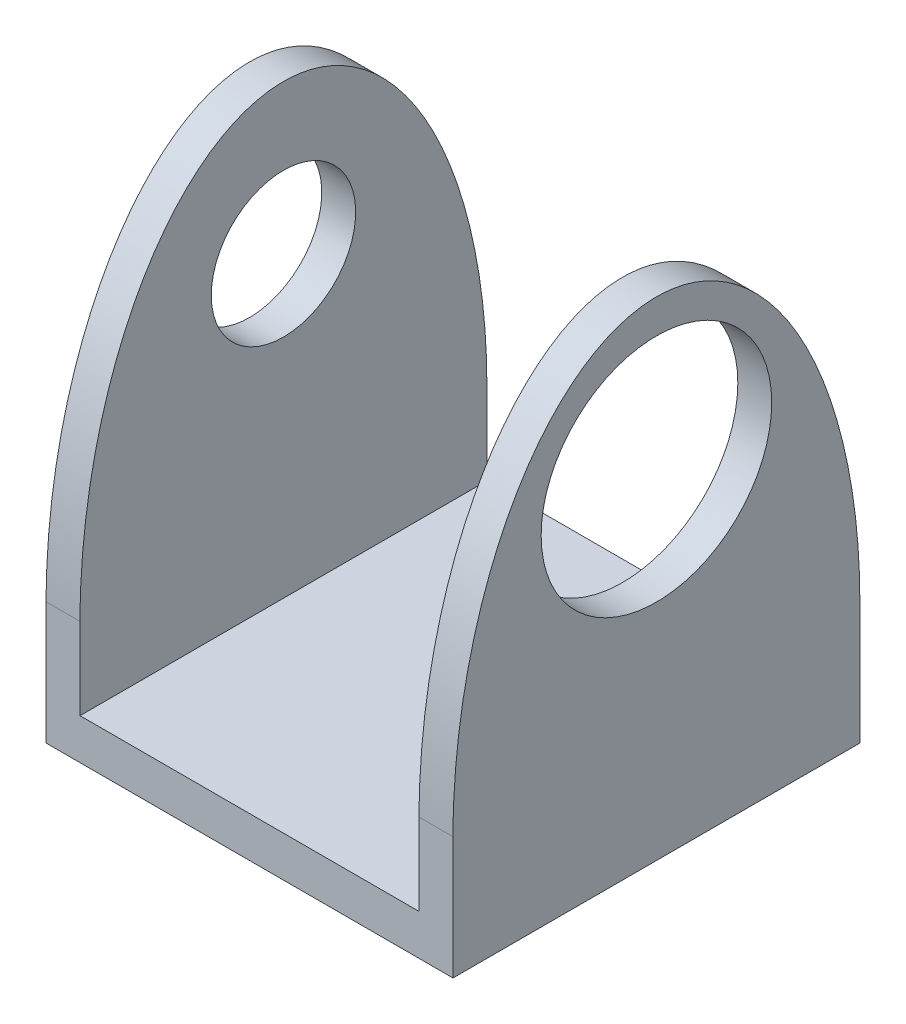
ISO-10303-21;
HEADER;
FILE_DESCRIPTION(('STEP AP214'),'2;1');
FILE_NAME('part.step','',(''),(''),'','','');
FILE_SCHEMA(('AUTOMOTIVE_DESIGN { 1 0 10303 214 1 1 1 1 }'));
ENDSEC;
DATA;
#1=APPLICATION_CONTEXT('core data for automotive mechanical design processes');
#2=APPLICATION_PROTOCOL_DEFINITION('international standard','automotive_design',2000,#1);
#3=PRODUCT_CONTEXT('',#1,'mechanical');
#4=PRODUCT('Part','Part','',(#3));
#5=PRODUCT_RELATED_PRODUCT_CATEGORY('part','',(#4));
#6=PRODUCT_DEFINITION_FORMATION('','',#4);
#7=PRODUCT_DEFINITION_CONTEXT('part definition',#1,'design');
#8=PRODUCT_DEFINITION('design','',#6,#7);
#9=PRODUCT_DEFINITION_SHAPE('','',#8);
#10=(LENGTH_UNIT() NAMED_UNIT(*) SI_UNIT(.MILLI.,.METRE.));
#11=(NAMED_UNIT(*) PLANE_ANGLE_UNIT() SI_UNIT($,.RADIAN.));
#12=(NAMED_UNIT(*) SI_UNIT($,.STERADIAN.) SOLID_ANGLE_UNIT());
#13=UNCERTAINTY_MEASURE_WITH_UNIT(LENGTH_MEASURE(1.E-05),#10,'distance_accuracy_value','');
#14=(GEOMETRIC_REPRESENTATION_CONTEXT(3) GLOBAL_UNCERTAINTY_ASSIGNED_CONTEXT((#13)) GLOBAL_UNIT_ASSIGNED_CONTEXT((#10,
#11,#12)) REPRESENTATION_CONTEXT('',''));
#15=CARTESIAN_POINT('',(0.,0.,0.));
#16=DIRECTION('',(0.,0.,1.));
#17=DIRECTION('',(1.,0.,0.));
#18=AXIS2_PLACEMENT_3D('',#15,#16,#17);
#19=CARTESIAN_POINT('',(-3.35387323943662,-2.29181338028169,7.62));
#20=DIRECTION('',(0.,1.,0.));
#21=DIRECTION('',(0.,0.,1.));
#22=AXIS2_PLACEMENT_3D('',#19,#20,#21);
#23=PLANE('',#22);
#24=DIRECTION('',(1.,0.,0.));
#25=VECTOR('',#24,1.);
#26=CARTESIAN_POINT('',(-3.35387323943662,-2.29181338028169,0.));
#27=LINE('',#26,#25);
#28=CARTESIAN_POINT('',(-3.35387323943662,-2.29181338028169,0.));
#29=VERTEX_POINT('',#28);
#30=CARTESIAN_POINT('',(4.26612676056338,-2.29181338028169,0.));
#31=VERTEX_POINT('',#30);
#32=EDGE_CURVE('E221',#29,#31,#27,.T.);
#33=ORIENTED_EDGE('',*,*,#32,.T.);
#34=DIRECTION('',(0.,0.,-1.));
#35=VECTOR('',#34,1.);
#36=CARTESIAN_POINT('',(4.26612676056338,-2.29181338028169,7.62));
#37=LINE('',#36,#35);
#38=CARTESIAN_POINT('',(4.26612676056338,-2.29181338028169,7.62));
#39=VERTEX_POINT('',#38);
#40=EDGE_CURVE('E224',#39,#31,#37,.T.);
#41=ORIENTED_EDGE('',*,*,#40,.F.);
#42=DIRECTION('',(1.,0.,0.));
#43=VECTOR('',#42,1.);
#44=CARTESIAN_POINT('',(-3.35387323943662,-2.29181338028169,7.62));
#45=LINE('',#44,#43);
#46=CARTESIAN_POINT('',(-3.35387323943662,-2.29181338028169,7.62));
#47=VERTEX_POINT('',#46);
#48=EDGE_CURVE('E279',#47,#39,#45,.T.);
#49=ORIENTED_EDGE('',*,*,#48,.F.);
#50=DIRECTION('',(0.,0.,-1.));
#51=VECTOR('',#50,1.);
#52=CARTESIAN_POINT('',(-3.35387323943662,-2.29181338028169,7.62));
#53=LINE('',#52,#51);
#54=EDGE_CURVE('E227',#47,#29,#53,.T.);
#55=ORIENTED_EDGE('',*,*,#54,.T.);
#56=EDGE_LOOP('',(#33,#41,#49,#55));
#57=FACE_BOUND('',#56,.T.);
#58=DIRECTION('',(0.,0.,1.));
#59=VECTOR('',#58,1.);
#60=CARTESIAN_POINT('',(3.25908068825592,-2.29181338028169,1.44789902015817));
#61=LINE('',#60,#59);
#62=CARTESIAN_POINT('',(3.25908068825592,-2.29181338028169,1.44789902015817));
#63=VERTEX_POINT('',#62);
#64=CARTESIAN_POINT('',(3.25908068825592,-2.29181338028169,6.23741252767155));
#65=VERTEX_POINT('',#64);
#66=EDGE_CURVE('E57',#63,#65,#61,.T.);
#67=ORIENTED_EDGE('',*,*,#66,.F.);
#68=DIRECTION('',(1.,0.,0.));
#69=VECTOR('',#68,1.);
#70=CARTESIAN_POINT('',(-2.08558097581017,-2.29181338028169,1.44789902015817));
#71=LINE('',#70,#69);
#72=CARTESIAN_POINT('',(-2.08558097581017,-2.29181338028169,1.44789902015817));
#73=VERTEX_POINT('',#72);
#74=EDGE_CURVE('E61',#73,#63,#71,.T.);
#75=ORIENTED_EDGE('',*,*,#74,.F.);
#76=DIRECTION('',(0.,0.,-1.));
#77=VECTOR('',#76,1.);
#78=CARTESIAN_POINT('',(-2.08558097581017,-2.29181338028169,6.23741252767155));
#79=LINE('',#78,#77);
#80=CARTESIAN_POINT('',(-2.08558097581017,-2.29181338028169,6.23741252767155));
#81=VERTEX_POINT('',#80);
#82=EDGE_CURVE('E449',#81,#73,#79,.T.);
#83=ORIENTED_EDGE('',*,*,#82,.F.);
#84=DIRECTION('',(-1.,0.,0.));
#85=VECTOR('',#84,1.);
#86=CARTESIAN_POINT('',(3.25908068825592,-2.29181338028169,6.23741252767155));
#87=LINE('',#86,#85);
#88=EDGE_CURVE('E459',#65,#81,#87,.T.);
#89=ORIENTED_EDGE('',*,*,#88,.F.);
#90=EDGE_LOOP('',(#67,#75,#83,#89));
#91=FACE_BOUND('',#90,.T.);
#92=ADVANCED_FACE('F41',(#57,#91),#23,.F.);
#93=CARTESIAN_POINT('',(-3.35387323943662,6.85218661971831,7.62));
#94=DIRECTION('',(1.,0.,0.));
#95=DIRECTION('',(0.,1.,0.));
#96=AXIS2_PLACEMENT_3D('',#93,#94,#95);
#97=PLANE('',#96);
#98=CARTESIAN_POINT('',(-3.35387323943662,4.05818661971831,3.81));
#99=DIRECTION('',(-1.,0.,0.));
#100=DIRECTION('',(0.,0.,1.));
#101=AXIS2_PLACEMENT_3D('',#98,#99,#100);
#102=CIRCLE('',#101,1.35254999999999);
#103=CARTESIAN_POINT('',(-3.35387323943662,4.05818661971831,5.16254999999999));
#104=VERTEX_POINT('',#103);
#105=EDGE_CURVE('E294',#104,#104,#102,.T.);
#106=ORIENTED_EDGE('',*,*,#105,.F.);
#107=EDGE_LOOP('',(#106));
#108=FACE_BOUND('',#107,.T.);
#109=DIRECTION('',(0.,-1.,0.));
#110=VECTOR('',#109,1.);
#111=CARTESIAN_POINT('',(-3.35387323943662,6.85218661971831,7.62));
#112=LINE('',#111,#110);
#113=CARTESIAN_POINT('',(-3.35387323943662,0.,7.62));
#114=VERTEX_POINT('',#113);
#115=EDGE_CURVE('E257',#114,#47,#112,.T.);
#116=ORIENTED_EDGE('',*,*,#115,.F.);
#117=CARTESIAN_POINT('',(-3.35387323943662,0.,3.81));
#118=DIRECTION('',(1.,0.,0.));
#119=DIRECTION('',(0.,1.,0.));
#120=AXIS2_PLACEMENT_3D('',#117,#118,#119);
#121=ELLIPSE('',#120,6.85218661971831,3.81);
#122=CARTESIAN_POINT('',(-3.35387323943662,0.,0.));
#123=VERTEX_POINT('',#122);
#124=EDGE_CURVE('E165',#123,#114,#121,.T.);
#125=ORIENTED_EDGE('',*,*,#124,.F.);
#126=DIRECTION('',(0.,-1.,0.));
#127=VECTOR('',#126,1.);
#128=CARTESIAN_POINT('',(-3.35387323943662,6.85218661971831,0.));
#129=LINE('',#128,#127);
#130=EDGE_CURVE('E232',#123,#29,#129,.T.);
#131=ORIENTED_EDGE('',*,*,#130,.T.);
#132=ORIENTED_EDGE('',*,*,#54,.F.);
#133=EDGE_LOOP('',(#116,#125,#131,#132));
#134=FACE_BOUND('',#133,.T.);
#135=ADVANCED_FACE('F43',(#108,#134),#97,.F.);
#136=CARTESIAN_POINT('',(4.26612676056338,-2.29181338028169,7.62));
#137=DIRECTION('',(-1.,0.,0.));
#138=DIRECTION('',(0.,-1.,0.));
#139=AXIS2_PLACEMENT_3D('',#136,#137,#138);
#140=PLANE('',#139);
#141=CARTESIAN_POINT('',(4.26612676056338,4.05818661971831,3.81));
#142=DIRECTION('',(1.,0.,0.));
#143=DIRECTION('',(0.,0.,-1.));
#144=AXIS2_PLACEMENT_3D('',#141,#142,#143);
#145=CIRCLE('',#144,2.159);
#146=CARTESIAN_POINT('',(4.26612676056338,4.05818661971831,1.651));
#147=VERTEX_POINT('',#146);
#148=EDGE_CURVE('E298',#147,#147,#145,.T.);
#149=ORIENTED_EDGE('',*,*,#148,.F.);
#150=EDGE_LOOP('',(#149));
#151=FACE_BOUND('',#150,.T.);
#152=CARTESIAN_POINT('',(4.26612676056338,0.,3.81));
#153=DIRECTION('',(1.,0.,0.));
#154=DIRECTION('',(0.,1.,0.));
#155=AXIS2_PLACEMENT_3D('',#152,#153,#154);
#156=ELLIPSE('',#155,6.85218661971831,3.81);
#157=CARTESIAN_POINT('',(4.26612676056338,0.,0.));
#158=VERTEX_POINT('',#157);
#159=CARTESIAN_POINT('',(4.26612676056338,0.,7.62));
#160=VERTEX_POINT('',#159);
#161=EDGE_CURVE('E159',#158,#160,#156,.T.);
#162=ORIENTED_EDGE('',*,*,#161,.T.);
#163=DIRECTION('',(0.,1.,0.));
#164=VECTOR('',#163,1.);
#165=CARTESIAN_POINT('',(4.26612676056338,-2.29181338028169,7.62));
#166=LINE('',#165,#164);
#167=EDGE_CURVE('E237',#39,#160,#166,.T.);
#168=ORIENTED_EDGE('',*,*,#167,.F.);
#169=ORIENTED_EDGE('',*,*,#40,.T.);
#170=DIRECTION('',(0.,1.,0.));
#171=VECTOR('',#170,1.);
#172=CARTESIAN_POINT('',(4.26612676056338,-2.29181338028169,0.));
#173=LINE('',#172,#171);
#174=EDGE_CURVE('E231',#31,#158,#173,.T.);
#175=ORIENTED_EDGE('',*,*,#174,.T.);
#176=EDGE_LOOP('',(#162,#168,#169,#175));
#177=FACE_BOUND('',#176,.T.);
#178=ADVANCED_FACE('F206',(#151,#177),#140,.F.);
#179=CARTESIAN_POINT('',(3.63112676056338,6.85218661971831,7.62));
#180=DIRECTION('',(1.,0.,0.));
#181=DIRECTION('',(0.,1.,0.));
#182=AXIS2_PLACEMENT_3D('',#179,#180,#181);
#183=PLANE('',#182);
#184=CARTESIAN_POINT('',(3.63112676056338,4.05818661971831,3.81));
#185=DIRECTION('',(1.,0.,0.));
#186=DIRECTION('',(0.,1.,0.));
#187=AXIS2_PLACEMENT_3D('',#184,#185,#186);
#188=CIRCLE('',#187,2.159);
#189=CARTESIAN_POINT('',(3.63112676056338,6.21718661971831,3.81));
#190=VERTEX_POINT('',#189);
#191=EDGE_CURVE('E303',#190,#190,#188,.F.);
#192=ORIENTED_EDGE('',*,*,#191,.F.);
#193=EDGE_LOOP('',(#192));
#194=FACE_BOUND('',#193,.T.);
#195=DIRECTION('',(0.,-1.,0.));
#196=VECTOR('',#195,1.);
#197=CARTESIAN_POINT('',(3.63112676056338,6.85218661971831,7.62));
#198=LINE('',#197,#196);
#199=CARTESIAN_POINT('',(3.63112676056338,0.,7.62));
#200=VERTEX_POINT('',#199);
#201=CARTESIAN_POINT('',(3.63112676056338,-1.52981338028169,7.62));
#202=VERTEX_POINT('',#201);
#203=EDGE_CURVE('E274',#200,#202,#198,.T.);
#204=ORIENTED_EDGE('',*,*,#203,.F.);
#205=CARTESIAN_POINT('',(3.63112676056338,0.,3.81));
#206=DIRECTION('',(1.,0.,0.));
#207=DIRECTION('',(0.,1.,0.));
#208=AXIS2_PLACEMENT_3D('',#205,#206,#207);
#209=ELLIPSE('',#208,6.85218661971831,3.81);
#210=CARTESIAN_POINT('',(3.63112676056338,0.,0.));
#211=VERTEX_POINT('',#210);
#212=EDGE_CURVE('E309',#211,#200,#209,.T.);
#213=ORIENTED_EDGE('',*,*,#212,.F.);
#214=DIRECTION('',(0.,-1.,0.));
#215=VECTOR('',#214,1.);
#216=CARTESIAN_POINT('',(3.63112676056338,6.85218661971831,0.));
#217=LINE('',#216,#215);
#218=CARTESIAN_POINT('',(3.63112676056338,-1.52981338028169,0.));
#219=VERTEX_POINT('',#218);
#220=EDGE_CURVE('E244',#211,#219,#217,.T.);
#221=ORIENTED_EDGE('',*,*,#220,.T.);
#222=DIRECTION('',(0.,0.,-1.));
#223=VECTOR('',#222,1.);
#224=CARTESIAN_POINT('',(3.63112676056338,-1.52981338028169,7.62));
#225=LINE('',#224,#223);
#226=EDGE_CURVE('E239',#202,#219,#225,.T.);
#227=ORIENTED_EDGE('',*,*,#226,.F.);
#228=EDGE_LOOP('',(#204,#213,#221,#227));
#229=FACE_BOUND('',#228,.T.);
#230=ADVANCED_FACE('F199',(#194,#229),#183,.F.);
#231=CARTESIAN_POINT('',(-2.71887323943662,-1.52981338028169,7.62));
#232=DIRECTION('',(-1.,0.,0.));
#233=DIRECTION('',(0.,-1.,0.));
#234=AXIS2_PLACEMENT_3D('',#231,#232,#233);
#235=PLANE('',#234);
#236=CARTESIAN_POINT('',(-2.71887323943662,4.05818661971831,3.81));
#237=DIRECTION('',(-1.,0.,0.));
#238=DIRECTION('',(0.,-1.,0.));
#239=AXIS2_PLACEMENT_3D('',#236,#237,#238);
#240=CIRCLE('',#239,1.35254999999999);
#241=CARTESIAN_POINT('',(-2.71887323943662,2.70563661971832,3.81));
#242=VERTEX_POINT('',#241);
#243=EDGE_CURVE('E287',#242,#242,#240,.T.);
#244=ORIENTED_EDGE('',*,*,#243,.T.);
#245=EDGE_LOOP('',(#244));
#246=FACE_BOUND('',#245,.T.);
#247=CARTESIAN_POINT('',(-2.71887323943662,0.,3.81));
#248=DIRECTION('',(1.,0.,0.));
#249=DIRECTION('',(0.,1.,0.));
#250=AXIS2_PLACEMENT_3D('',#247,#248,#249);
#251=ELLIPSE('',#250,6.85218661971831,3.81);
#252=CARTESIAN_POINT('',(-2.71887323943662,0.,7.62));
#253=VERTEX_POINT('',#252);
#254=CARTESIAN_POINT('',(-2.71887323943662,0.,0.));
#255=VERTEX_POINT('',#254);
#256=EDGE_CURVE('E312',#253,#255,#251,.F.);
#257=ORIENTED_EDGE('',*,*,#256,.F.);
#258=DIRECTION('',(0.,1.,0.));
#259=VECTOR('',#258,1.);
#260=CARTESIAN_POINT('',(-2.71887323943662,-1.52981338028169,7.62));
#261=LINE('',#260,#259);
#262=CARTESIAN_POINT('',(-2.71887323943662,-1.52981338028169,7.62));
#263=VERTEX_POINT('',#262);
#264=EDGE_CURVE('E262',#263,#253,#261,.T.);
#265=ORIENTED_EDGE('',*,*,#264,.F.);
#266=DIRECTION('',(0.,0.,-1.));
#267=VECTOR('',#266,1.);
#268=CARTESIAN_POINT('',(-2.71887323943662,-1.52981338028169,7.62));
#269=LINE('',#268,#267);
#270=CARTESIAN_POINT('',(-2.71887323943662,-1.52981338028169,0.));
#271=VERTEX_POINT('',#270);
#272=EDGE_CURVE('E258',#263,#271,#269,.T.);
#273=ORIENTED_EDGE('',*,*,#272,.T.);
#274=DIRECTION('',(0.,1.,0.));
#275=VECTOR('',#274,1.);
#276=CARTESIAN_POINT('',(-2.71887323943662,-1.52981338028169,0.));
#277=LINE('',#276,#275);
#278=EDGE_CURVE('E253',#271,#255,#277,.T.);
#279=ORIENTED_EDGE('',*,*,#278,.T.);
#280=EDGE_LOOP('',(#257,#265,#273,#279));
#281=FACE_BOUND('',#280,.T.);
#282=ADVANCED_FACE('F196',(#246,#281),#235,.F.);
#283=CARTESIAN_POINT('',(3.63112676056338,-1.52981338028169,7.62));
#284=DIRECTION('',(0.,-1.,0.));
#285=DIRECTION('',(1.,0.,0.));
#286=AXIS2_PLACEMENT_3D('',#283,#284,#285);
#287=PLANE('',#286);
#288=DIRECTION('',(-1.,0.,0.));
#289=VECTOR('',#288,1.);
#290=CARTESIAN_POINT('',(3.63112676056338,-1.52981338028169,0.));
#291=LINE('',#290,#289);
#292=EDGE_CURVE('E247',#219,#271,#291,.T.);
#293=ORIENTED_EDGE('',*,*,#292,.T.);
#294=ORIENTED_EDGE('',*,*,#272,.F.);
#295=DIRECTION('',(-1.,0.,0.));
#296=VECTOR('',#295,1.);
#297=CARTESIAN_POINT('',(3.63112676056338,-1.52981338028169,7.62));
#298=LINE('',#297,#296);
#299=EDGE_CURVE('E271',#202,#263,#298,.T.);
#300=ORIENTED_EDGE('',*,*,#299,.F.);
#301=ORIENTED_EDGE('',*,*,#226,.T.);
#302=EDGE_LOOP('',(#293,#294,#300,#301));
#303=FACE_BOUND('',#302,.T.);
#304=ADVANCED_FACE('F191',(#303),#287,.F.);
#305=CARTESIAN_POINT('',(0.,0.,7.62));
#306=DIRECTION('',(0.,0.,1.));
#307=DIRECTION('',(1.,0.,0.));
#308=AXIS2_PLACEMENT_3D('',#305,#306,#307);
#309=PLANE('',#308);
#310=DIRECTION('',(1.,0.,0.));
#311=VECTOR('',#310,1.);
#312=CARTESIAN_POINT('',(-3.35387323943662,0.,7.62));
#313=LINE('',#312,#311);
#314=EDGE_CURVE('E154',#114,#253,#313,.T.);
#315=ORIENTED_EDGE('',*,*,#314,.F.);
#316=ORIENTED_EDGE('',*,*,#115,.T.);
#317=ORIENTED_EDGE('',*,*,#48,.T.);
#318=ORIENTED_EDGE('',*,*,#167,.T.);
#319=DIRECTION('',(1.,0.,0.));
#320=VECTOR('',#319,1.);
#321=CARTESIAN_POINT('',(-3.35387323943662,0.,7.62));
#322=LINE('',#321,#320);
#323=EDGE_CURVE('E11',#200,#160,#322,.T.);
#324=ORIENTED_EDGE('',*,*,#323,.F.);
#325=ORIENTED_EDGE('',*,*,#203,.T.);
#326=ORIENTED_EDGE('',*,*,#299,.T.);
#327=ORIENTED_EDGE('',*,*,#264,.T.);
#328=EDGE_LOOP('',(#315,#316,#317,#318,#324,#325,#326,#327));
#329=FACE_BOUND('',#328,.T.);
#330=ADVANCED_FACE('F188',(#329),#309,.T.);
#331=CARTESIAN_POINT('',(0.,0.,0.));
#332=DIRECTION('',(0.,0.,1.));
#333=DIRECTION('',(1.,0.,0.));
#334=AXIS2_PLACEMENT_3D('',#331,#332,#333);
#335=PLANE('',#334);
#336=ORIENTED_EDGE('',*,*,#130,.F.);
#337=DIRECTION('',(1.,0.,0.));
#338=VECTOR('',#337,1.);
#339=CARTESIAN_POINT('',(-3.35387323943662,0.,0.));
#340=LINE('',#339,#338);
#341=EDGE_CURVE('E169',#123,#255,#340,.T.);
#342=ORIENTED_EDGE('',*,*,#341,.T.);
#343=ORIENTED_EDGE('',*,*,#278,.F.);
#344=ORIENTED_EDGE('',*,*,#292,.F.);
#345=ORIENTED_EDGE('',*,*,#220,.F.);
#346=DIRECTION('',(1.,0.,0.));
#347=VECTOR('',#346,1.);
#348=CARTESIAN_POINT('',(-3.35387323943662,0.,0.));
#349=LINE('',#348,#347);
#350=EDGE_CURVE('E50',#211,#158,#349,.T.);
#351=ORIENTED_EDGE('',*,*,#350,.T.);
#352=ORIENTED_EDGE('',*,*,#174,.F.);
#353=ORIENTED_EDGE('',*,*,#32,.F.);
#354=EDGE_LOOP('',(#336,#342,#343,#344,#345,#351,#352,#353));
#355=FACE_BOUND('',#354,.T.);
#356=ADVANCED_FACE('F186',(#355),#335,.F.);
#357=CARTESIAN_POINT('',(-3.35387323943662,4.05818661971831,3.81));
#358=DIRECTION('',(-1.,0.,0.));
#359=DIRECTION('',(0.,0.,1.));
#360=AXIS2_PLACEMENT_3D('',#357,#358,#359);
#361=CYLINDRICAL_SURFACE('',#360,1.35254999999999);
#362=ORIENTED_EDGE('',*,*,#243,.F.);
#363=EDGE_LOOP('',(#362));
#364=FACE_BOUND('',#363,.T.);
#365=ORIENTED_EDGE('',*,*,#105,.T.);
#366=EDGE_LOOP('',(#365));
#367=FACE_BOUND('',#366,.T.);
#368=ADVANCED_FACE('F182',(#364,#367),#361,.F.);
#369=CARTESIAN_POINT('',(-3.35487323943662,4.05818661971831,3.81));
#370=DIRECTION('',(1.,0.,0.));
#371=DIRECTION('',(0.,0.,-1.));
#372=AXIS2_PLACEMENT_3D('',#369,#370,#371);
#373=CYLINDRICAL_SURFACE('',#372,2.159);
#374=ORIENTED_EDGE('',*,*,#148,.T.);
#375=EDGE_LOOP('',(#374));
#376=FACE_BOUND('',#375,.T.);
#377=ORIENTED_EDGE('',*,*,#191,.T.);
#378=EDGE_LOOP('',(#377));
#379=FACE_BOUND('',#378,.T.);
#380=ADVANCED_FACE('F177',(#376,#379),#373,.F.);
#381=DIRECTION('',(1.,0.,0.));
#382=VECTOR('',#381,1.);
#383=SURFACE_OF_LINEAR_EXTRUSION('',#121,#382);
#384=ORIENTED_EDGE('',*,*,#212,.T.);
#385=ORIENTED_EDGE('',*,*,#323,.T.);
#386=ORIENTED_EDGE('',*,*,#161,.F.);
#387=ORIENTED_EDGE('',*,*,#350,.F.);
#388=EDGE_LOOP('',(#384,#385,#386,#387));
#389=FACE_BOUND('',#388,.T.);
#390=ADVANCED_FACE('F172',(#389),#383,.T.);
#391=ORIENTED_EDGE('',*,*,#256,.T.);
#392=ORIENTED_EDGE('',*,*,#341,.F.);
#393=ORIENTED_EDGE('',*,*,#124,.T.);
#394=ORIENTED_EDGE('',*,*,#314,.T.);
#395=EDGE_LOOP('',(#391,#392,#393,#394));
#396=FACE_BOUND('',#395,.T.);
#397=ADVANCED_FACE('F176',(#396),#383,.T.);
#398=CARTESIAN_POINT('',(3.25908068825592,-2.31721338028169,1.44789902015817));
#399=DIRECTION('',(-1.,0.,0.));
#400=DIRECTION('',(0.,0.,1.));
#401=AXIS2_PLACEMENT_3D('',#398,#399,#400);
#402=PLANE('',#401);
#403=ORIENTED_EDGE('',*,*,#66,.T.);
#404=DIRECTION('',(0.,1.,0.));
#405=VECTOR('',#404,1.);
#406=CARTESIAN_POINT('',(3.25908068825592,-2.31721338028169,6.23741252767155));
#407=LINE('',#406,#405);
#408=CARTESIAN_POINT('',(3.25908068825592,-2.31721338028169,6.23741252767155));
#409=VERTEX_POINT('',#408);
#410=EDGE_CURVE('E134',#409,#65,#407,.T.);
#411=ORIENTED_EDGE('',*,*,#410,.F.);
#412=DIRECTION('',(0.,0.,1.));
#413=VECTOR('',#412,1.);
#414=CARTESIAN_POINT('',(3.25908068825592,-2.31721338028169,1.44789902015817));
#415=LINE('',#414,#413);
#416=CARTESIAN_POINT('',(3.25908068825592,-2.31721338028169,1.44789902015817));
#417=VERTEX_POINT('',#416);
#418=EDGE_CURVE('E141',#417,#409,#415,.T.);
#419=ORIENTED_EDGE('',*,*,#418,.F.);
#420=DIRECTION('',(0.,1.,0.));
#421=VECTOR('',#420,1.);
#422=CARTESIAN_POINT('',(3.25908068825592,-2.31721338028169,1.44789902015817));
#423=LINE('',#422,#421);
#424=EDGE_CURVE('E446',#417,#63,#423,.T.);
#425=ORIENTED_EDGE('',*,*,#424,.T.);
#426=EDGE_LOOP('',(#403,#411,#419,#425));
#427=FACE_BOUND('',#426,.T.);
#428=ADVANCED_FACE('F152',(#427),#402,.F.);
#429=CARTESIAN_POINT('',(3.25908068825592,-2.31721338028169,6.23741252767155));
#430=DIRECTION('',(0.,0.,-1.));
#431=DIRECTION('',(-1.,0.,0.));
#432=AXIS2_PLACEMENT_3D('',#429,#430,#431);
#433=PLANE('',#432);
#434=ORIENTED_EDGE('',*,*,#88,.T.);
#435=DIRECTION('',(0.,1.,0.));
#436=VECTOR('',#435,1.);
#437=CARTESIAN_POINT('',(-2.08558097581017,-2.31721338028169,6.23741252767155));
#438=LINE('',#437,#436);
#439=CARTESIAN_POINT('',(-2.08558097581017,-2.31721338028169,6.23741252767155));
#440=VERTEX_POINT('',#439);
#441=EDGE_CURVE('E136',#440,#81,#438,.T.);
#442=ORIENTED_EDGE('',*,*,#441,.F.);
#443=DIRECTION('',(-1.,0.,0.));
#444=VECTOR('',#443,1.);
#445=CARTESIAN_POINT('',(3.25908068825592,-2.31721338028169,6.23741252767155));
#446=LINE('',#445,#444);
#447=EDGE_CURVE('E129',#409,#440,#446,.T.);
#448=ORIENTED_EDGE('',*,*,#447,.F.);
#449=ORIENTED_EDGE('',*,*,#410,.T.);
#450=EDGE_LOOP('',(#434,#442,#448,#449));
#451=FACE_BOUND('',#450,.T.);
#452=ADVANCED_FACE('F132',(#451),#433,.F.);
#453=CARTESIAN_POINT('',(-2.08558097581017,-2.31721338028169,6.23741252767155));
#454=DIRECTION('',(1.,0.,0.));
#455=DIRECTION('',(0.,0.,-1.));
#456=AXIS2_PLACEMENT_3D('',#453,#454,#455);
#457=PLANE('',#456);
#458=ORIENTED_EDGE('',*,*,#82,.T.);
#459=DIRECTION('',(0.,1.,0.));
#460=VECTOR('',#459,1.);
#461=CARTESIAN_POINT('',(-2.08558097581017,-2.31721338028169,1.44789902015817));
#462=LINE('',#461,#460);
#463=CARTESIAN_POINT('',(-2.08558097581017,-2.31721338028169,1.44789902015817));
#464=VERTEX_POINT('',#463);
#465=EDGE_CURVE('E161',#464,#73,#462,.T.);
#466=ORIENTED_EDGE('',*,*,#465,.F.);
#467=DIRECTION('',(0.,0.,-1.));
#468=VECTOR('',#467,1.);
#469=CARTESIAN_POINT('',(-2.08558097581017,-2.31721338028169,6.23741252767155));
#470=LINE('',#469,#468);
#471=EDGE_CURVE('E140',#440,#464,#470,.T.);
#472=ORIENTED_EDGE('',*,*,#471,.F.);
#473=ORIENTED_EDGE('',*,*,#441,.T.);
#474=EDGE_LOOP('',(#458,#466,#472,#473));
#475=FACE_BOUND('',#474,.T.);
#476=ADVANCED_FACE('F334',(#475),#457,.F.);
#477=CARTESIAN_POINT('',(-2.08558097581017,-2.31721338028169,1.44789902015817));
#478=DIRECTION('',(0.,0.,1.));
#479=DIRECTION('',(1.,0.,0.));
#480=AXIS2_PLACEMENT_3D('',#477,#478,#479);
#481=PLANE('',#480);
#482=ORIENTED_EDGE('',*,*,#74,.T.);
#483=ORIENTED_EDGE('',*,*,#424,.F.);
#484=DIRECTION('',(1.,0.,0.));
#485=VECTOR('',#484,1.);
#486=CARTESIAN_POINT('',(-2.08558097581017,-2.31721338028169,1.44789902015817));
#487=LINE('',#486,#485);
#488=EDGE_CURVE('E146',#464,#417,#487,.T.);
#489=ORIENTED_EDGE('',*,*,#488,.F.);
#490=ORIENTED_EDGE('',*,*,#465,.T.);
#491=EDGE_LOOP('',(#482,#483,#489,#490));
#492=FACE_BOUND('',#491,.T.);
#493=ADVANCED_FACE('F338',(#492),#481,.F.);
#494=CARTESIAN_POINT('',(0.,-2.31721338028169,0.));
#495=DIRECTION('',(0.,-1.,0.));
#496=DIRECTION('',(0.,0.,-1.));
#497=AXIS2_PLACEMENT_3D('',#494,#495,#496);
#498=PLANE('',#497);
#499=ORIENTED_EDGE('',*,*,#418,.T.);
#500=ORIENTED_EDGE('',*,*,#447,.T.);
#501=ORIENTED_EDGE('',*,*,#471,.T.);
#502=ORIENTED_EDGE('',*,*,#488,.T.);
#503=EDGE_LOOP('',(#499,#500,#501,#502));
#504=FACE_BOUND('',#503,.T.);
#505=ADVANCED_FACE('F144',(#504),#498,.T.);
#506=CLOSED_SHELL('',(#92,#135,#178,#230,#282,#304,#330,#356,#368,#380,#390,#397,#428,#452,#476,
#493,#505));
#507=MANIFOLD_SOLID_BREP('B2',#506);
#508=ADVANCED_BREP_SHAPE_REPRESENTATION('',(#18,#507),#14);
#509=SHAPE_DEFINITION_REPRESENTATION(#9,#508);
ENDSEC;
END-ISO-10303-21;
